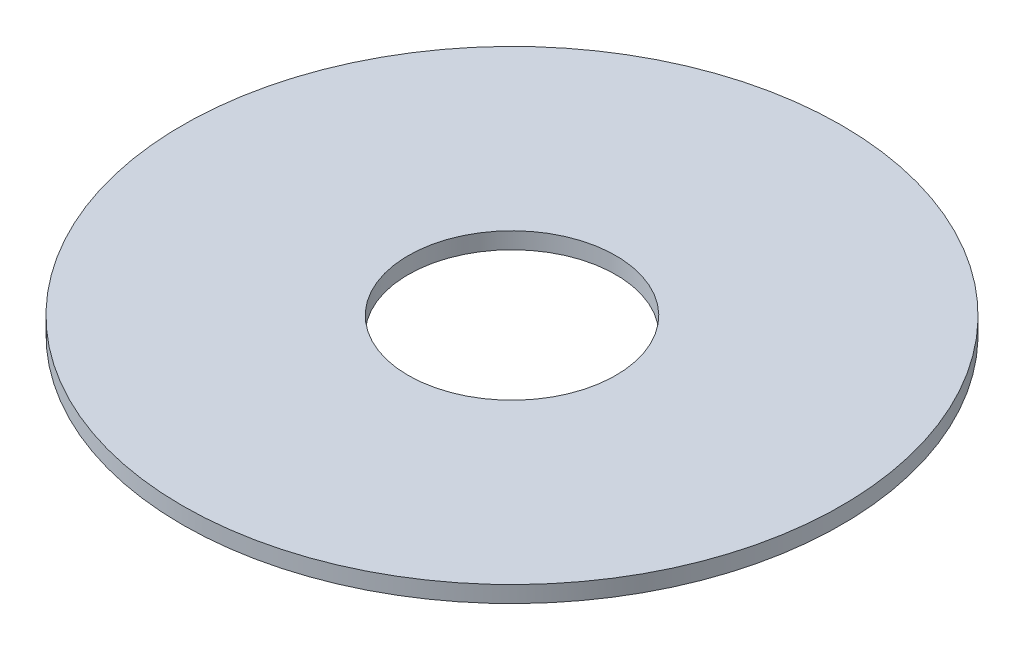
ISO-10303-21;
HEADER;
FILE_DESCRIPTION(('STEP AP214'),'2;1');
FILE_NAME('part.step','',(''),(''),'','','');
FILE_SCHEMA(('AUTOMOTIVE_DESIGN { 1 0 10303 214 1 1 1 1 }'));
ENDSEC;
DATA;
#1=APPLICATION_CONTEXT('core data for automotive mechanical design processes');
#2=APPLICATION_PROTOCOL_DEFINITION('international standard','automotive_design',2000,#1);
#3=PRODUCT_CONTEXT('',#1,'mechanical');
#4=PRODUCT('Part','Part','',(#3));
#5=PRODUCT_RELATED_PRODUCT_CATEGORY('part','',(#4));
#6=PRODUCT_DEFINITION_FORMATION('','',#4);
#7=PRODUCT_DEFINITION_CONTEXT('part definition',#1,'design');
#8=PRODUCT_DEFINITION('design','',#6,#7);
#9=PRODUCT_DEFINITION_SHAPE('','',#8);
#10=(LENGTH_UNIT() NAMED_UNIT(*) SI_UNIT(.MILLI.,.METRE.));
#11=(NAMED_UNIT(*) PLANE_ANGLE_UNIT() SI_UNIT($,.RADIAN.));
#12=(NAMED_UNIT(*) SI_UNIT($,.STERADIAN.) SOLID_ANGLE_UNIT());
#13=UNCERTAINTY_MEASURE_WITH_UNIT(LENGTH_MEASURE(1.E-05),#10,'distance_accuracy_value','');
#14=(GEOMETRIC_REPRESENTATION_CONTEXT(3) GLOBAL_UNCERTAINTY_ASSIGNED_CONTEXT((#13)) GLOBAL_UNIT_ASSIGNED_CONTEXT((#10,
#11,#12)) REPRESENTATION_CONTEXT('',''));
#15=CARTESIAN_POINT('',(0.,0.,0.));
#16=DIRECTION('',(0.,0.,1.));
#17=DIRECTION('',(1.,0.,0.));
#18=AXIS2_PLACEMENT_3D('',#15,#16,#17);
#19=CARTESIAN_POINT('',(0.,5.,0.));
#20=DIRECTION('',(0.,1.,0.));
#21=DIRECTION('',(0.,0.,1.));
#22=AXIS2_PLACEMENT_3D('',#19,#20,#21);
#23=PLANE('',#22);
#24=CARTESIAN_POINT('',(0.,5.,0.));
#25=DIRECTION('',(0.,1.,0.));
#26=DIRECTION('',(0.,0.,1.));
#27=AXIS2_PLACEMENT_3D('',#24,#25,#26);
#28=CIRCLE('',#27,100.);
#29=CARTESIAN_POINT('',(0.,5.,100.));
#30=VERTEX_POINT('',#29);
#31=EDGE_CURVE('E10',#30,#30,#28,.T.);
#32=ORIENTED_EDGE('',*,*,#31,.T.);
#33=EDGE_LOOP('',(#32));
#34=FACE_BOUND('',#33,.T.);
#35=CARTESIAN_POINT('',(0.,5.,0.));
#36=DIRECTION('',(0.,1.,0.));
#37=DIRECTION('',(0.,0.,1.));
#38=AXIS2_PLACEMENT_3D('',#35,#36,#37);
#39=CIRCLE('',#38,31.5);
#40=CARTESIAN_POINT('',(0.,5.,31.5));
#41=VERTEX_POINT('',#40);
#42=EDGE_CURVE('E44',#41,#41,#39,.T.);
#43=ORIENTED_EDGE('',*,*,#42,.F.);
#44=EDGE_LOOP('',(#43));
#45=FACE_BOUND('',#44,.T.);
#46=ADVANCED_FACE('F33',(#34,#45),#23,.T.);
#47=CARTESIAN_POINT('',(0.,0.,0.));
#48=DIRECTION('',(0.,1.,0.));
#49=DIRECTION('',(0.,0.,1.));
#50=AXIS2_PLACEMENT_3D('',#47,#48,#49);
#51=PLANE('',#50);
#52=CARTESIAN_POINT('',(0.,0.,0.));
#53=DIRECTION('',(0.,1.,0.));
#54=DIRECTION('',(0.,0.,1.));
#55=AXIS2_PLACEMENT_3D('',#52,#53,#54);
#56=CIRCLE('',#55,100.);
#57=CARTESIAN_POINT('',(0.,0.,100.));
#58=VERTEX_POINT('',#57);
#59=EDGE_CURVE('E37',#58,#58,#56,.T.);
#60=ORIENTED_EDGE('',*,*,#59,.F.);
#61=EDGE_LOOP('',(#60));
#62=FACE_BOUND('',#61,.T.);
#63=CARTESIAN_POINT('',(0.,0.,0.));
#64=DIRECTION('',(0.,1.,0.));
#65=DIRECTION('',(0.,0.,1.));
#66=AXIS2_PLACEMENT_3D('',#63,#64,#65);
#67=CIRCLE('',#66,31.5);
#68=CARTESIAN_POINT('',(0.,0.,31.5));
#69=VERTEX_POINT('',#68);
#70=EDGE_CURVE('E46',#69,#69,#67,.T.);
#71=ORIENTED_EDGE('',*,*,#70,.T.);
#72=EDGE_LOOP('',(#71));
#73=FACE_BOUND('',#72,.T.);
#74=ADVANCED_FACE('F56',(#62,#73),#51,.F.);
#75=CARTESIAN_POINT('',(0.,5.,0.));
#76=DIRECTION('',(0.,-1.,0.));
#77=DIRECTION('',(0.,0.,-1.));
#78=AXIS2_PLACEMENT_3D('',#75,#76,#77);
#79=CYLINDRICAL_SURFACE('',#78,100.);
#80=ORIENTED_EDGE('',*,*,#31,.F.);
#81=EDGE_LOOP('',(#80));
#82=FACE_BOUND('',#81,.T.);
#83=ORIENTED_EDGE('',*,*,#59,.T.);
#84=EDGE_LOOP('',(#83));
#85=FACE_BOUND('',#84,.T.);
#86=ADVANCED_FACE('F35',(#82,#85),#79,.T.);
#87=CARTESIAN_POINT('',(0.,5.,0.));
#88=DIRECTION('',(0.,-1.,0.));
#89=DIRECTION('',(0.,0.,-1.));
#90=AXIS2_PLACEMENT_3D('',#87,#88,#89);
#91=CYLINDRICAL_SURFACE('',#90,31.5);
#92=ORIENTED_EDGE('',*,*,#42,.T.);
#93=EDGE_LOOP('',(#92));
#94=FACE_BOUND('',#93,.T.);
#95=ORIENTED_EDGE('',*,*,#70,.F.);
#96=EDGE_LOOP('',(#95));
#97=FACE_BOUND('',#96,.T.);
#98=ADVANCED_FACE('F52',(#94,#97),#91,.F.);
#99=CLOSED_SHELL('',(#46,#74,#86,#98));
#100=MANIFOLD_SOLID_BREP('B2',#99);
#101=ADVANCED_BREP_SHAPE_REPRESENTATION('',(#18,#100),#14);
#102=SHAPE_DEFINITION_REPRESENTATION(#9,#101);
ENDSEC;
END-ISO-10303-21;
